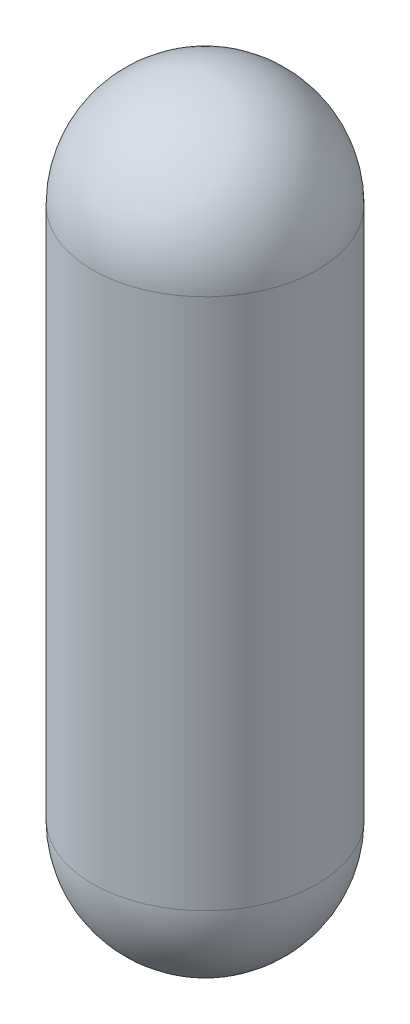
ISO-10303-21;
HEADER;
FILE_DESCRIPTION(('STEP AP214'),'2;1');
FILE_NAME('part.step','',(''),(''),'','','');
FILE_SCHEMA(('AUTOMOTIVE_DESIGN { 1 0 10303 214 1 1 1 1 }'));
ENDSEC;
DATA;
#1=APPLICATION_CONTEXT('core data for automotive mechanical design processes');
#2=APPLICATION_PROTOCOL_DEFINITION('international standard','automotive_design',2000,#1);
#3=PRODUCT_CONTEXT('',#1,'mechanical');
#4=PRODUCT('Part','Part','',(#3));
#5=PRODUCT_RELATED_PRODUCT_CATEGORY('part','',(#4));
#6=PRODUCT_DEFINITION_FORMATION('','',#4);
#7=PRODUCT_DEFINITION_CONTEXT('part definition',#1,'design');
#8=PRODUCT_DEFINITION('design','',#6,#7);
#9=PRODUCT_DEFINITION_SHAPE('','',#8);
#10=(LENGTH_UNIT() NAMED_UNIT(*) SI_UNIT(.MILLI.,.METRE.));
#11=(NAMED_UNIT(*) PLANE_ANGLE_UNIT() SI_UNIT($,.RADIAN.));
#12=(NAMED_UNIT(*) SI_UNIT($,.STERADIAN.) SOLID_ANGLE_UNIT());
#13=UNCERTAINTY_MEASURE_WITH_UNIT(LENGTH_MEASURE(1.E-05),#10,'distance_accuracy_value','');
#14=(GEOMETRIC_REPRESENTATION_CONTEXT(3) GLOBAL_UNCERTAINTY_ASSIGNED_CONTEXT((#13)) GLOBAL_UNIT_ASSIGNED_CONTEXT((#10,
#11,#12)) REPRESENTATION_CONTEXT('',''));
#15=CARTESIAN_POINT('',(0.,0.,0.));
#16=DIRECTION('',(0.,0.,1.));
#17=DIRECTION('',(1.,0.,0.));
#18=AXIS2_PLACEMENT_3D('',#15,#16,#17);
#19=CARTESIAN_POINT('',(2.77555756156289E-13,-2008.38168701443,0.));
#20=DIRECTION('',(0.,-1.,0.));
#21=DIRECTION('',(1.,0.,0.));
#22=AXIS2_PLACEMENT_3D('',#19,#20,#21);
#23=SPHERICAL_SURFACE('',#22,654.05);
#24=CARTESIAN_POINT('',(1.7034985129859E-13,-2008.38168701443,0.));
#25=DIRECTION('',(0.,-1.,0.));
#26=DIRECTION('',(1.,0.,0.));
#27=AXIS2_PLACEMENT_3D('',#24,#25,#26);
#28=CIRCLE('',#27,654.05);
#29=CARTESIAN_POINT('',(654.05,-2008.38168701443,0.));
#30=VERTEX_POINT('',#29);
#31=EDGE_CURVE('E45',#30,#30,#28,.T.);
#32=ORIENTED_EDGE('',*,*,#31,.T.);
#33=EDGE_LOOP('',(#32));
#34=FACE_BOUND('',#33,.T.);
#35=ADVANCED_FACE('F39',(#34),#23,.T.);
#36=CARTESIAN_POINT('',(2.77555756156289E-13,1083.51831298557,0.));
#37=DIRECTION('',(0.,-1.,0.));
#38=DIRECTION('',(1.,0.,0.));
#39=AXIS2_PLACEMENT_3D('',#36,#37,#38);
#40=SPHERICAL_SURFACE('',#39,654.05);
#41=CARTESIAN_POINT('',(0.,1083.51831298557,0.));
#42=DIRECTION('',(0.,-1.,0.));
#43=DIRECTION('',(1.,0.,0.));
#44=AXIS2_PLACEMENT_3D('',#41,#42,#43);
#45=CIRCLE('',#44,654.05);
#46=CARTESIAN_POINT('',(654.05,1083.51831298557,0.));
#47=VERTEX_POINT('',#46);
#48=EDGE_CURVE('E10',#47,#47,#45,.T.);
#49=ORIENTED_EDGE('',*,*,#48,.F.);
#50=EDGE_LOOP('',(#49));
#51=FACE_BOUND('',#50,.T.);
#52=ADVANCED_FACE('F54',(#51),#40,.T.);
#53=CARTESIAN_POINT('',(1.7034985129859E-13,-2008.38168701443,0.));
#54=DIRECTION('',(0.,-1.,0.));
#55=DIRECTION('',(1.,0.,0.));
#56=AXIS2_PLACEMENT_3D('',#53,#54,#55);
#57=CYLINDRICAL_SURFACE('',#56,654.05);
#58=ORIENTED_EDGE('',*,*,#48,.T.);
#59=EDGE_LOOP('',(#58));
#60=FACE_BOUND('',#59,.T.);
#61=ORIENTED_EDGE('',*,*,#31,.F.);
#62=EDGE_LOOP('',(#61));
#63=FACE_BOUND('',#62,.T.);
#64=ADVANCED_FACE('F52',(#60,#63),#57,.T.);
#65=CLOSED_SHELL('',(#35,#52,#64));
#66=MANIFOLD_SOLID_BREP('B2',#65);
#67=ADVANCED_BREP_SHAPE_REPRESENTATION('',(#18,#66),#14);
#68=SHAPE_DEFINITION_REPRESENTATION(#9,#67);
ENDSEC;
END-ISO-10303-21;
